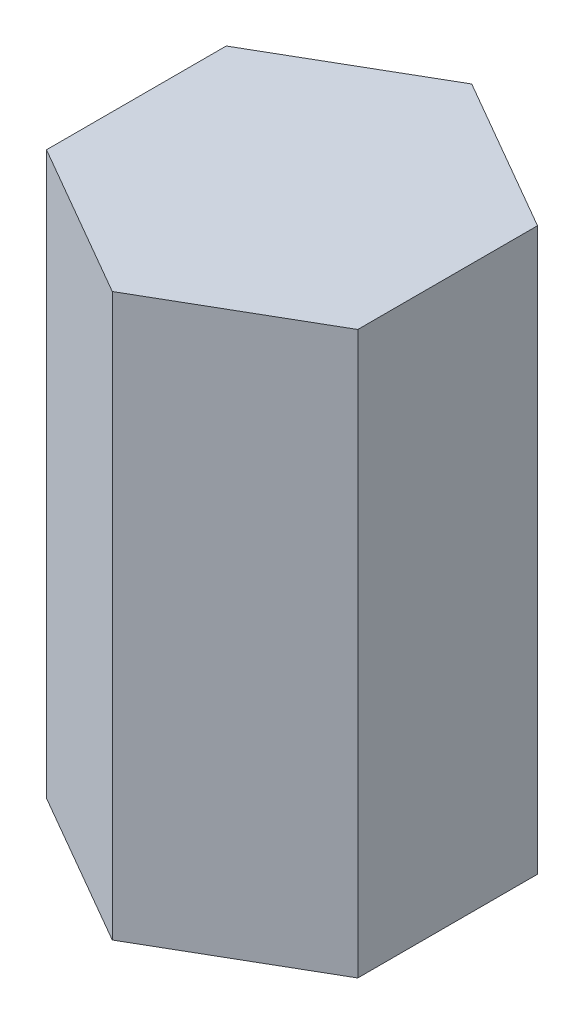
ISO-10303-21;
HEADER;
FILE_DESCRIPTION(('STEP AP214'),'2;1');
FILE_NAME('part.step','',(''),(''),'','','');
FILE_SCHEMA(('AUTOMOTIVE_DESIGN { 1 0 10303 214 1 1 1 1 }'));
ENDSEC;
DATA;
#1=APPLICATION_CONTEXT('core data for automotive mechanical design processes');
#2=APPLICATION_PROTOCOL_DEFINITION('international standard','automotive_design',2000,#1);
#3=PRODUCT_CONTEXT('',#1,'mechanical');
#4=PRODUCT('Part','Part','',(#3));
#5=PRODUCT_RELATED_PRODUCT_CATEGORY('part','',(#4));
#6=PRODUCT_DEFINITION_FORMATION('','',#4);
#7=PRODUCT_DEFINITION_CONTEXT('part definition',#1,'design');
#8=PRODUCT_DEFINITION('design','',#6,#7);
#9=PRODUCT_DEFINITION_SHAPE('','',#8);
#10=(LENGTH_UNIT() NAMED_UNIT(*) SI_UNIT(.MILLI.,.METRE.));
#11=(NAMED_UNIT(*) PLANE_ANGLE_UNIT() SI_UNIT($,.RADIAN.));
#12=(NAMED_UNIT(*) SI_UNIT($,.STERADIAN.) SOLID_ANGLE_UNIT());
#13=UNCERTAINTY_MEASURE_WITH_UNIT(LENGTH_MEASURE(1.E-05),#10,'distance_accuracy_value','');
#14=(GEOMETRIC_REPRESENTATION_CONTEXT(3) GLOBAL_UNCERTAINTY_ASSIGNED_CONTEXT((#13)) GLOBAL_UNIT_ASSIGNED_CONTEXT((#10,
#11,#12)) REPRESENTATION_CONTEXT('',''));
#15=CARTESIAN_POINT('',(0.,0.,0.));
#16=DIRECTION('',(0.,0.,1.));
#17=DIRECTION('',(1.,0.,0.));
#18=AXIS2_PLACEMENT_3D('',#15,#16,#17);
#19=CARTESIAN_POINT('',(0.,0.,0.));
#20=DIRECTION('',(0.,1.,0.));
#21=DIRECTION('',(0.,0.,1.));
#22=AXIS2_PLACEMENT_3D('',#19,#20,#21);
#23=PLANE('',#22);
#24=DIRECTION('',(-0.866025403784439,0.,0.5));
#25=VECTOR('',#24,1.);
#26=CARTESIAN_POINT('',(-2.63964543073497,0.,-4.572));
#27=LINE('',#26,#25);
#28=CARTESIAN_POINT('',(0.,0.,-6.096));
#29=VERTEX_POINT('',#28);
#30=CARTESIAN_POINT('',(-5.27929086146994,0.,-3.048));
#31=VERTEX_POINT('',#30);
#32=EDGE_CURVE('E132',#29,#31,#27,.T.);
#33=ORIENTED_EDGE('',*,*,#32,.F.);
#34=DIRECTION('',(-0.866025403784439,0.,-0.5));
#35=VECTOR('',#34,1.);
#36=CARTESIAN_POINT('',(2.63964543073497,0.,-4.572));
#37=LINE('',#36,#35);
#38=CARTESIAN_POINT('',(5.27929086146994,0.,-3.048));
#39=VERTEX_POINT('',#38);
#40=EDGE_CURVE('E86',#39,#29,#37,.T.);
#41=ORIENTED_EDGE('',*,*,#40,.F.);
#42=DIRECTION('',(0.,0.,-1.));
#43=VECTOR('',#42,1.);
#44=CARTESIAN_POINT('',(5.27929086146994,0.,0.));
#45=LINE('',#44,#43);
#46=CARTESIAN_POINT('',(5.27929086146994,0.,3.048));
#47=VERTEX_POINT('',#46);
#48=EDGE_CURVE('E141',#47,#39,#45,.T.);
#49=ORIENTED_EDGE('',*,*,#48,.F.);
#50=DIRECTION('',(0.866025403784439,0.,-0.5));
#51=VECTOR('',#50,1.);
#52=CARTESIAN_POINT('',(2.63964543073497,0.,4.572));
#53=LINE('',#52,#51);
#54=CARTESIAN_POINT('',(0.,0.,6.096));
#55=VERTEX_POINT('',#54);
#56=EDGE_CURVE('E120',#55,#47,#53,.T.);
#57=ORIENTED_EDGE('',*,*,#56,.F.);
#58=DIRECTION('',(0.866025403784439,0.,0.5));
#59=VECTOR('',#58,1.);
#60=CARTESIAN_POINT('',(-2.63964543073497,0.,4.572));
#61=LINE('',#60,#59);
#62=CARTESIAN_POINT('',(-5.27929086146994,0.,3.048));
#63=VERTEX_POINT('',#62);
#64=EDGE_CURVE('E138',#63,#55,#61,.T.);
#65=ORIENTED_EDGE('',*,*,#64,.F.);
#66=DIRECTION('',(0.,0.,1.));
#67=VECTOR('',#66,1.);
#68=CARTESIAN_POINT('',(-5.27929086146994,0.,0.));
#69=LINE('',#68,#67);
#70=EDGE_CURVE('E135',#31,#63,#69,.T.);
#71=ORIENTED_EDGE('',*,*,#70,.F.);
#72=EDGE_LOOP('',(#33,#41,#49,#57,#65,#71));
#73=FACE_BOUND('',#72,.T.);
#74=CARTESIAN_POINT('',(0.,0.,0.));
#75=DIRECTION('',(0.,1.,0.));
#76=DIRECTION('',(0.,0.,1.));
#77=AXIS2_PLACEMENT_3D('',#74,#75,#76);
#78=CIRCLE('',#77,2.7305);
#79=CARTESIAN_POINT('',(2.,0.,-1.85893255660338));
#80=VERTEX_POINT('',#79);
#81=CARTESIAN_POINT('',(2.,0.,1.85893255660338));
#82=VERTEX_POINT('',#81);
#83=EDGE_CURVE('E50',#80,#82,#78,.T.);
#84=ORIENTED_EDGE('',*,*,#83,.T.);
#85=DIRECTION('',(0.,0.,-1.));
#86=VECTOR('',#85,1.);
#87=CARTESIAN_POINT('',(2.,0.,1.85893255660338));
#88=LINE('',#87,#86);
#89=EDGE_CURVE('E165',#82,#80,#88,.T.);
#90=ORIENTED_EDGE('',*,*,#89,.T.);
#91=EDGE_LOOP('',(#84,#90));
#92=FACE_BOUND('',#91,.T.);
#93=ADVANCED_FACE('F35',(#73,#92),#23,.F.);
#94=CARTESIAN_POINT('',(-2.63964543073497,19.05,-4.572));
#95=DIRECTION('',(0.5,0.,0.866025403784439));
#96=DIRECTION('',(0.866025403784438,0.,-0.5));
#97=AXIS2_PLACEMENT_3D('',#94,#95,#96);
#98=PLANE('',#97);
#99=ORIENTED_EDGE('',*,*,#32,.T.);
#100=DIRECTION('',(0.,-1.,0.));
#101=VECTOR('',#100,1.);
#102=CARTESIAN_POINT('',(-5.27929086146994,19.05,-3.048));
#103=LINE('',#102,#101);
#104=CARTESIAN_POINT('',(-5.27929086146994,19.05,-3.048));
#105=VERTEX_POINT('',#104);
#106=EDGE_CURVE('E11',#105,#31,#103,.T.);
#107=ORIENTED_EDGE('',*,*,#106,.F.);
#108=DIRECTION('',(-0.866025403784439,0.,0.5));
#109=VECTOR('',#108,1.);
#110=CARTESIAN_POINT('',(-2.63964543073497,19.05,-4.572));
#111=LINE('',#110,#109);
#112=CARTESIAN_POINT('',(0.,19.05,-6.096));
#113=VERTEX_POINT('',#112);
#114=EDGE_CURVE('E144',#113,#105,#111,.T.);
#115=ORIENTED_EDGE('',*,*,#114,.F.);
#116=DIRECTION('',(0.,-1.,0.));
#117=VECTOR('',#116,1.);
#118=CARTESIAN_POINT('',(0.,19.05,-6.096));
#119=LINE('',#118,#117);
#120=EDGE_CURVE('E128',#113,#29,#119,.T.);
#121=ORIENTED_EDGE('',*,*,#120,.T.);
#122=EDGE_LOOP('',(#99,#107,#115,#121));
#123=FACE_BOUND('',#122,.T.);
#124=ADVANCED_FACE('F37',(#123),#98,.F.);
#125=CARTESIAN_POINT('',(-5.27929086146994,19.05,0.));
#126=DIRECTION('',(1.,0.,0.));
#127=DIRECTION('',(0.,0.,-1.));
#128=AXIS2_PLACEMENT_3D('',#125,#126,#127);
#129=PLANE('',#128);
#130=ORIENTED_EDGE('',*,*,#70,.T.);
#131=DIRECTION('',(0.,-1.,0.));
#132=VECTOR('',#131,1.);
#133=CARTESIAN_POINT('',(-5.27929086146994,19.05,3.048));
#134=LINE('',#133,#132);
#135=CARTESIAN_POINT('',(-5.27929086146994,19.05,3.048));
#136=VERTEX_POINT('',#135);
#137=EDGE_CURVE('E43',#136,#63,#134,.T.);
#138=ORIENTED_EDGE('',*,*,#137,.F.);
#139=DIRECTION('',(0.,0.,1.));
#140=VECTOR('',#139,1.);
#141=CARTESIAN_POINT('',(-5.27929086146994,19.05,0.));
#142=LINE('',#141,#140);
#143=EDGE_CURVE('E94',#105,#136,#142,.T.);
#144=ORIENTED_EDGE('',*,*,#143,.F.);
#145=ORIENTED_EDGE('',*,*,#106,.T.);
#146=EDGE_LOOP('',(#130,#138,#144,#145));
#147=FACE_BOUND('',#146,.T.);
#148=ADVANCED_FACE('F188',(#147),#129,.F.);
#149=CARTESIAN_POINT('',(-2.63964543073497,19.05,4.572));
#150=DIRECTION('',(0.5,0.,-0.866025403784439));
#151=DIRECTION('',(-0.866025403784439,0.,-0.5));
#152=AXIS2_PLACEMENT_3D('',#149,#150,#151);
#153=PLANE('',#152);
#154=ORIENTED_EDGE('',*,*,#64,.T.);
#155=DIRECTION('',(0.,-1.,0.));
#156=VECTOR('',#155,1.);
#157=CARTESIAN_POINT('',(0.,19.05,6.096));
#158=LINE('',#157,#156);
#159=CARTESIAN_POINT('',(0.,19.05,6.096));
#160=VERTEX_POINT('',#159);
#161=EDGE_CURVE('E123',#160,#55,#158,.T.);
#162=ORIENTED_EDGE('',*,*,#161,.F.);
#163=DIRECTION('',(0.866025403784439,0.,0.5));
#164=VECTOR('',#163,1.);
#165=CARTESIAN_POINT('',(-2.63964543073497,19.05,4.572));
#166=LINE('',#165,#164);
#167=EDGE_CURVE('E111',#136,#160,#166,.T.);
#168=ORIENTED_EDGE('',*,*,#167,.F.);
#169=ORIENTED_EDGE('',*,*,#137,.T.);
#170=EDGE_LOOP('',(#154,#162,#168,#169));
#171=FACE_BOUND('',#170,.T.);
#172=ADVANCED_FACE('F150',(#171),#153,.F.);
#173=CARTESIAN_POINT('',(2.63964543073497,19.05,4.572));
#174=DIRECTION('',(-0.5,0.,-0.866025403784439));
#175=DIRECTION('',(-0.866025403784438,0.,0.5));
#176=AXIS2_PLACEMENT_3D('',#173,#174,#175);
#177=PLANE('',#176);
#178=ORIENTED_EDGE('',*,*,#56,.T.);
#179=DIRECTION('',(0.,-1.,0.));
#180=VECTOR('',#179,1.);
#181=CARTESIAN_POINT('',(5.27929086146994,19.05,3.048));
#182=LINE('',#181,#180);
#183=CARTESIAN_POINT('',(5.27929086146994,19.05,3.048));
#184=VERTEX_POINT('',#183);
#185=EDGE_CURVE('E117',#184,#47,#182,.T.);
#186=ORIENTED_EDGE('',*,*,#185,.F.);
#187=DIRECTION('',(0.866025403784439,0.,-0.5));
#188=VECTOR('',#187,1.);
#189=CARTESIAN_POINT('',(2.63964543073497,19.05,4.572));
#190=LINE('',#189,#188);
#191=EDGE_CURVE('E104',#160,#184,#190,.T.);
#192=ORIENTED_EDGE('',*,*,#191,.F.);
#193=ORIENTED_EDGE('',*,*,#161,.T.);
#194=EDGE_LOOP('',(#178,#186,#192,#193));
#195=FACE_BOUND('',#194,.T.);
#196=ADVANCED_FACE('F118',(#195),#177,.F.);
#197=CARTESIAN_POINT('',(5.27929086146994,19.05,0.));
#198=DIRECTION('',(-1.,0.,0.));
#199=DIRECTION('',(0.,0.,1.));
#200=AXIS2_PLACEMENT_3D('',#197,#198,#199);
#201=PLANE('',#200);
#202=ORIENTED_EDGE('',*,*,#48,.T.);
#203=DIRECTION('',(0.,-1.,0.));
#204=VECTOR('',#203,1.);
#205=CARTESIAN_POINT('',(5.27929086146994,19.05,-3.048));
#206=LINE('',#205,#204);
#207=CARTESIAN_POINT('',(5.27929086146994,19.05,-3.048));
#208=VERTEX_POINT('',#207);
#209=EDGE_CURVE('E124',#208,#39,#206,.T.);
#210=ORIENTED_EDGE('',*,*,#209,.F.);
#211=DIRECTION('',(0.,0.,-1.));
#212=VECTOR('',#211,1.);
#213=CARTESIAN_POINT('',(5.27929086146994,19.05,0.));
#214=LINE('',#213,#212);
#215=EDGE_CURVE('E108',#184,#208,#214,.T.);
#216=ORIENTED_EDGE('',*,*,#215,.F.);
#217=ORIENTED_EDGE('',*,*,#185,.T.);
#218=EDGE_LOOP('',(#202,#210,#216,#217));
#219=FACE_BOUND('',#218,.T.);
#220=ADVANCED_FACE('F126',(#219),#201,.F.);
#221=CARTESIAN_POINT('',(2.63964543073497,19.05,-4.572));
#222=DIRECTION('',(-0.5,0.,0.866025403784439));
#223=DIRECTION('',(0.866025403784439,0.,0.5));
#224=AXIS2_PLACEMENT_3D('',#221,#222,#223);
#225=PLANE('',#224);
#226=ORIENTED_EDGE('',*,*,#40,.T.);
#227=ORIENTED_EDGE('',*,*,#120,.F.);
#228=DIRECTION('',(-0.866025403784439,0.,-0.5));
#229=VECTOR('',#228,1.);
#230=CARTESIAN_POINT('',(2.63964543073497,19.05,-4.572));
#231=LINE('',#230,#229);
#232=EDGE_CURVE('E59',#208,#113,#231,.T.);
#233=ORIENTED_EDGE('',*,*,#232,.F.);
#234=ORIENTED_EDGE('',*,*,#209,.T.);
#235=EDGE_LOOP('',(#226,#227,#233,#234));
#236=FACE_BOUND('',#235,.T.);
#237=ADVANCED_FACE('F154',(#236),#225,.F.);
#238=CARTESIAN_POINT('',(0.,19.05,0.));
#239=DIRECTION('',(0.,1.,0.));
#240=DIRECTION('',(0.,0.,1.));
#241=AXIS2_PLACEMENT_3D('',#238,#239,#240);
#242=PLANE('',#241);
#243=ORIENTED_EDGE('',*,*,#114,.T.);
#244=ORIENTED_EDGE('',*,*,#143,.T.);
#245=ORIENTED_EDGE('',*,*,#167,.T.);
#246=ORIENTED_EDGE('',*,*,#191,.T.);
#247=ORIENTED_EDGE('',*,*,#215,.T.);
#248=ORIENTED_EDGE('',*,*,#232,.T.);
#249=EDGE_LOOP('',(#243,#244,#245,#246,#247,#248));
#250=FACE_BOUND('',#249,.T.);
#251=ADVANCED_FACE('F106',(#250),#242,.T.);
#252=CARTESIAN_POINT('',(0.,10.16,0.));
#253=DIRECTION('',(0.,-1.,0.));
#254=DIRECTION('',(0.,0.,-1.));
#255=AXIS2_PLACEMENT_3D('',#252,#253,#254);
#256=CYLINDRICAL_SURFACE('',#255,2.7305);
#257=ORIENTED_EDGE('',*,*,#83,.F.);
#258=DIRECTION('',(0.,-1.,0.));
#259=VECTOR('',#258,1.);
#260=CARTESIAN_POINT('',(2.,10.16,-1.85893255660338));
#261=LINE('',#260,#259);
#262=CARTESIAN_POINT('',(2.,10.16,-1.85893255660338));
#263=VERTEX_POINT('',#262);
#264=EDGE_CURVE('E162',#263,#80,#261,.T.);
#265=ORIENTED_EDGE('',*,*,#264,.F.);
#266=CARTESIAN_POINT('',(0.,10.16,0.));
#267=DIRECTION('',(0.,1.,0.));
#268=DIRECTION('',(0.,0.,1.));
#269=AXIS2_PLACEMENT_3D('',#266,#267,#268);
#270=CIRCLE('',#269,2.7305);
#271=CARTESIAN_POINT('',(2.,10.16,1.85893255660338));
#272=VERTEX_POINT('',#271);
#273=EDGE_CURVE('E168',#263,#272,#270,.T.);
#274=ORIENTED_EDGE('',*,*,#273,.T.);
#275=DIRECTION('',(0.,-1.,0.));
#276=VECTOR('',#275,1.);
#277=CARTESIAN_POINT('',(2.,10.16,1.85893255660338));
#278=LINE('',#277,#276);
#279=EDGE_CURVE('E136',#272,#82,#278,.T.);
#280=ORIENTED_EDGE('',*,*,#279,.T.);
#281=EDGE_LOOP('',(#257,#265,#274,#280));
#282=FACE_BOUND('',#281,.T.);
#283=ADVANCED_FACE('F176',(#282),#256,.F.);
#284=CARTESIAN_POINT('',(2.,10.16,1.85893255660338));
#285=DIRECTION('',(-1.,0.,0.));
#286=DIRECTION('',(0.,0.,1.));
#287=AXIS2_PLACEMENT_3D('',#284,#285,#286);
#288=PLANE('',#287);
#289=ORIENTED_EDGE('',*,*,#89,.F.);
#290=ORIENTED_EDGE('',*,*,#279,.F.);
#291=DIRECTION('',(0.,0.,-1.));
#292=VECTOR('',#291,1.);
#293=CARTESIAN_POINT('',(2.,10.16,1.85893255660338));
#294=LINE('',#293,#292);
#295=EDGE_CURVE('E164',#272,#263,#294,.T.);
#296=ORIENTED_EDGE('',*,*,#295,.T.);
#297=ORIENTED_EDGE('',*,*,#264,.T.);
#298=EDGE_LOOP('',(#289,#290,#296,#297));
#299=FACE_BOUND('',#298,.T.);
#300=ADVANCED_FACE('F182',(#299),#288,.T.);
#301=CARTESIAN_POINT('',(0.,10.16,0.));
#302=DIRECTION('',(0.,1.,0.));
#303=DIRECTION('',(0.,0.,1.));
#304=AXIS2_PLACEMENT_3D('',#301,#302,#303);
#305=PLANE('',#304);
#306=ORIENTED_EDGE('',*,*,#273,.F.);
#307=ORIENTED_EDGE('',*,*,#295,.F.);
#308=EDGE_LOOP('',(#306,#307));
#309=FACE_BOUND('',#308,.T.);
#310=ADVANCED_FACE('F236',(#309),#305,.F.);
#311=CLOSED_SHELL('',(#93,#124,#148,#172,#196,#220,#237,#251,#283,#300,#310));
#312=MANIFOLD_SOLID_BREP('B2',#311);
#313=ADVANCED_BREP_SHAPE_REPRESENTATION('',(#18,#312),#14);
#314=SHAPE_DEFINITION_REPRESENTATION(#9,#313);
ENDSEC;
END-ISO-10303-21;
